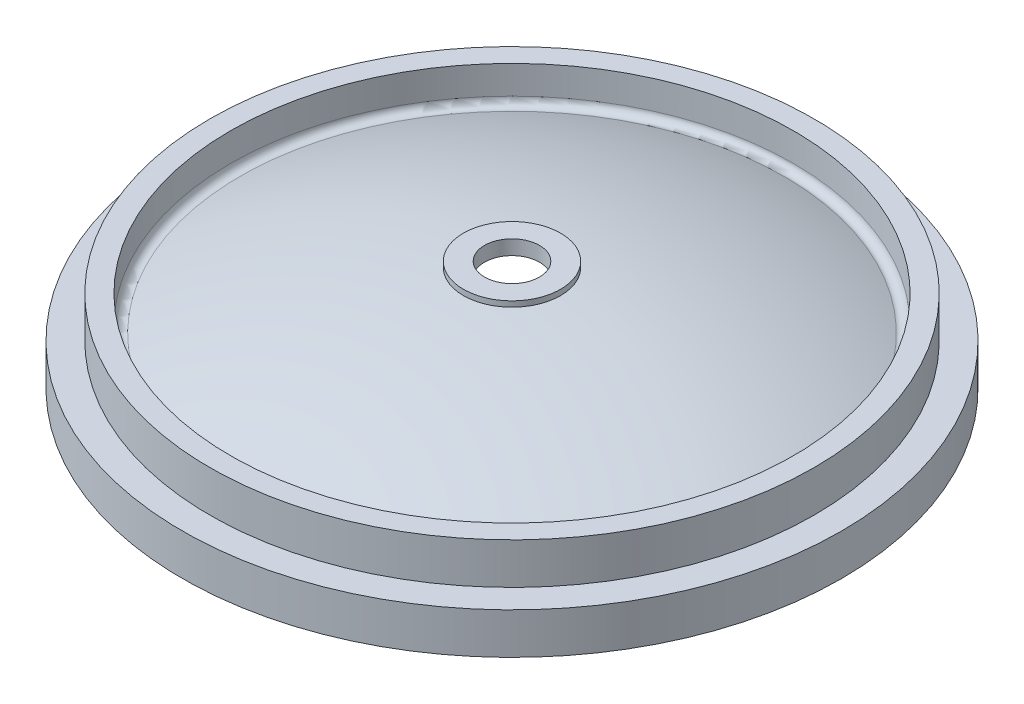
ISO-10303-21;
HEADER;
FILE_DESCRIPTION(('STEP AP214'),'2;1');
FILE_NAME('part.step','',(''),(''),'','','');
FILE_SCHEMA(('AUTOMOTIVE_DESIGN { 1 0 10303 214 1 1 1 1 }'));
ENDSEC;
DATA;
#1=APPLICATION_CONTEXT('core data for automotive mechanical design processes');
#2=APPLICATION_PROTOCOL_DEFINITION('international standard','automotive_design',2000,#1);
#3=PRODUCT_CONTEXT('',#1,'mechanical');
#4=PRODUCT('Part','Part','',(#3));
#5=PRODUCT_RELATED_PRODUCT_CATEGORY('part','',(#4));
#6=PRODUCT_DEFINITION_FORMATION('','',#4);
#7=PRODUCT_DEFINITION_CONTEXT('part definition',#1,'design');
#8=PRODUCT_DEFINITION('design','',#6,#7);
#9=PRODUCT_DEFINITION_SHAPE('','',#8);
#10=(LENGTH_UNIT() NAMED_UNIT(*) SI_UNIT(.MILLI.,.METRE.));
#11=(NAMED_UNIT(*) PLANE_ANGLE_UNIT() SI_UNIT($,.RADIAN.));
#12=(NAMED_UNIT(*) SI_UNIT($,.STERADIAN.) SOLID_ANGLE_UNIT());
#13=UNCERTAINTY_MEASURE_WITH_UNIT(LENGTH_MEASURE(1.E-05),#10,'distance_accuracy_value','');
#14=(GEOMETRIC_REPRESENTATION_CONTEXT(3) GLOBAL_UNCERTAINTY_ASSIGNED_CONTEXT((#13)) GLOBAL_UNIT_ASSIGNED_CONTEXT((#10,
#11,#12)) REPRESENTATION_CONTEXT('',''));
#15=CARTESIAN_POINT('',(0.,0.,0.));
#16=DIRECTION('',(0.,0.,1.));
#17=DIRECTION('',(1.,0.,0.));
#18=AXIS2_PLACEMENT_3D('',#15,#16,#17);
#19=CARTESIAN_POINT('',(0.,50.9224566717079,0.));
#20=DIRECTION('',(0.,1.,0.));
#21=DIRECTION('',(-1.,0.,0.));
#22=AXIS2_PLACEMENT_3D('',#19,#20,#21);
#23=CYLINDRICAL_SURFACE('',#22,139.7);
#24=CARTESIAN_POINT('',(0.,38.1,0.));
#25=DIRECTION('',(0.,1.,0.));
#26=DIRECTION('',(-1.,0.,0.));
#27=AXIS2_PLACEMENT_3D('',#24,#25,#26);
#28=CIRCLE('',#27,139.7);
#29=CARTESIAN_POINT('',(-139.7,38.0999999999999,0.));
#30=VERTEX_POINT('',#29);
#31=EDGE_CURVE('E44',#30,#30,#28,.T.);
#32=ORIENTED_EDGE('',*,*,#31,.F.);
#33=EDGE_LOOP('',(#32));
#34=FACE_BOUND('',#33,.T.);
#35=CARTESIAN_POINT('',(0.,19.05,0.));
#36=DIRECTION('',(0.,1.,0.));
#37=DIRECTION('',(-1.,0.,0.));
#38=AXIS2_PLACEMENT_3D('',#35,#36,#37);
#39=CIRCLE('',#38,139.7);
#40=CARTESIAN_POINT('',(-139.7,19.0499999999999,0.));
#41=VERTEX_POINT('',#40);
#42=EDGE_CURVE('E71',#41,#41,#39,.T.);
#43=ORIENTED_EDGE('',*,*,#42,.T.);
#44=EDGE_LOOP('',(#43));
#45=FACE_BOUND('',#44,.T.);
#46=ADVANCED_FACE('F33',(#34,#45),#23,.T.);
#47=CARTESIAN_POINT('',(139.7,38.1,0.));
#48=DIRECTION('',(0.,-1.,0.));
#49=DIRECTION('',(1.,0.,0.));
#50=AXIS2_PLACEMENT_3D('',#47,#48,#49);
#51=PLANE('',#50);
#52=CARTESIAN_POINT('',(0.,38.1,0.));
#53=DIRECTION('',(0.,1.,0.));
#54=DIRECTION('',(-1.,0.,0.));
#55=AXIS2_PLACEMENT_3D('',#52,#53,#54);
#56=CIRCLE('',#55,130.175);
#57=CARTESIAN_POINT('',(-130.175,38.0999999999999,0.));
#58=VERTEX_POINT('',#57);
#59=EDGE_CURVE('E48',#58,#58,#56,.T.);
#60=ORIENTED_EDGE('',*,*,#59,.F.);
#61=EDGE_LOOP('',(#60));
#62=FACE_BOUND('',#61,.T.);
#63=ORIENTED_EDGE('',*,*,#31,.T.);
#64=EDGE_LOOP('',(#63));
#65=FACE_BOUND('',#64,.T.);
#66=ADVANCED_FACE('F103',(#62,#65),#51,.F.);
#67=CARTESIAN_POINT('',(0.,50.9224566717079,0.));
#68=DIRECTION('',(0.,1.,0.));
#69=DIRECTION('',(-1.,0.,0.));
#70=AXIS2_PLACEMENT_3D('',#67,#68,#69);
#71=CYLINDRICAL_SURFACE('',#70,130.175);
#72=CARTESIAN_POINT('',(0.,24.9826349484652,0.));
#73=DIRECTION('',(0.,-1.,0.));
#74=DIRECTION('',(1.,0.,0.));
#75=AXIS2_PLACEMENT_3D('',#72,#73,#74);
#76=CIRCLE('',#75,130.175);
#77=CARTESIAN_POINT('',(130.175,24.9826349484652,0.));
#78=VERTEX_POINT('',#77);
#79=EDGE_CURVE('E10',#78,#78,#76,.T.);
#80=ORIENTED_EDGE('',*,*,#79,.T.);
#81=EDGE_LOOP('',(#80));
#82=FACE_BOUND('',#81,.T.);
#83=ORIENTED_EDGE('',*,*,#59,.T.);
#84=EDGE_LOOP('',(#83));
#85=FACE_BOUND('',#84,.T.);
#86=ADVANCED_FACE('F98',(#82,#85),#71,.F.);
#87=CARTESIAN_POINT('',(0.,-255.5875,0.));
#88=DIRECTION('',(0.,1.,0.));
#89=DIRECTION('',(1.,0.,0.));
#90=AXIS2_PLACEMENT_3D('',#87,#88,#89);
#91=SPHERICAL_SURFACE('',#90,304.8);
#92=CARTESIAN_POINT('',(-1.00086987964441E-13,22.0901593304398,0.));
#93=DIRECTION('',(0.,-1.,0.));
#94=DIRECTION('',(1.,0.,0.));
#95=AXIS2_PLACEMENT_3D('',#92,#93,#94);
#96=CIRCLE('',#95,125.690721649485);
#97=CARTESIAN_POINT('',(125.690721649484,22.0901593304398,0.));
#98=VERTEX_POINT('',#97);
#99=EDGE_CURVE('E40',#98,#98,#96,.F.);
#100=ORIENTED_EDGE('',*,*,#99,.T.);
#101=EDGE_LOOP('',(#100));
#102=FACE_BOUND('',#101,.T.);
#103=CARTESIAN_POINT('',(0.,48.3824566717079,0.));
#104=DIRECTION('',(0.,1.,0.));
#105=DIRECTION('',(-1.,0.,0.));
#106=AXIS2_PLACEMENT_3D('',#103,#104,#105);
#107=CIRCLE('',#106,22.479);
#108=CARTESIAN_POINT('',(-22.479,48.3824566717079,0.));
#109=VERTEX_POINT('',#108);
#110=EDGE_CURVE('E53',#109,#109,#107,.T.);
#111=ORIENTED_EDGE('',*,*,#110,.F.);
#112=EDGE_LOOP('',(#111));
#113=FACE_BOUND('',#112,.T.);
#114=ADVANCED_FACE('F93',(#102,#113),#91,.T.);
#115=CARTESIAN_POINT('',(0.,50.9224566717079,0.));
#116=DIRECTION('',(0.,1.,0.));
#117=DIRECTION('',(-1.,0.,0.));
#118=AXIS2_PLACEMENT_3D('',#115,#116,#117);
#119=CYLINDRICAL_SURFACE('',#118,22.479);
#120=CARTESIAN_POINT('',(0.,50.9224566717079,0.));
#121=DIRECTION('',(0.,1.,0.));
#122=DIRECTION('',(-1.,0.,0.));
#123=AXIS2_PLACEMENT_3D('',#120,#121,#122);
#124=CIRCLE('',#123,22.479);
#125=CARTESIAN_POINT('',(-22.479,50.9224566717079,0.));
#126=VERTEX_POINT('',#125);
#127=EDGE_CURVE('E56',#126,#126,#124,.T.);
#128=ORIENTED_EDGE('',*,*,#127,.F.);
#129=EDGE_LOOP('',(#128));
#130=FACE_BOUND('',#129,.T.);
#131=ORIENTED_EDGE('',*,*,#110,.T.);
#132=EDGE_LOOP('',(#131));
#133=FACE_BOUND('',#132,.T.);
#134=ADVANCED_FACE('F87',(#130,#133),#119,.T.);
#135=CARTESIAN_POINT('',(22.479,50.9224566717079,0.));
#136=DIRECTION('',(0.,-1.,0.));
#137=DIRECTION('',(1.,0.,0.));
#138=AXIS2_PLACEMENT_3D('',#135,#136,#137);
#139=PLANE('',#138);
#140=CARTESIAN_POINT('',(0.,50.9224566717079,0.));
#141=DIRECTION('',(0.,1.,0.));
#142=DIRECTION('',(0.,0.,1.));
#143=AXIS2_PLACEMENT_3D('',#140,#141,#142);
#144=CIRCLE('',#143,12.7);
#145=CARTESIAN_POINT('',(0.,50.9224566717079,12.7));
#146=VERTEX_POINT('',#145);
#147=EDGE_CURVE('E77',#146,#146,#144,.T.);
#148=ORIENTED_EDGE('',*,*,#147,.F.);
#149=EDGE_LOOP('',(#148));
#150=FACE_BOUND('',#149,.T.);
#151=ORIENTED_EDGE('',*,*,#127,.T.);
#152=EDGE_LOOP('',(#151));
#153=FACE_BOUND('',#152,.T.);
#154=ADVANCED_FACE('F83',(#150,#153),#139,.F.);
#155=CARTESIAN_POINT('',(0.,-247.65,0.));
#156=DIRECTION('',(0.,1.,0.));
#157=DIRECTION('',(1.,0.,0.));
#158=AXIS2_PLACEMENT_3D('',#155,#156,#157);
#159=SPHERICAL_SURFACE('',#158,292.1);
#160=CARTESIAN_POINT('',(0.,44.1737824441318,0.));
#161=DIRECTION('',(0.,-1.,0.));
#162=DIRECTION('',(0.,0.,-1.));
#163=AXIS2_PLACEMENT_3D('',#160,#161,#162);
#164=CIRCLE('',#163,12.7);
#165=CARTESIAN_POINT('',(0.,44.1737824441318,-12.7));
#166=VERTEX_POINT('',#165);
#167=EDGE_CURVE('E74',#166,#166,#164,.F.);
#168=ORIENTED_EDGE('',*,*,#167,.T.);
#169=EDGE_LOOP('',(#168));
#170=FACE_BOUND('',#169,.T.);
#171=CARTESIAN_POINT('',(0.,4.39281103366138,0.));
#172=DIRECTION('',(0.,1.,0.));
#173=DIRECTION('',(-1.,0.,0.));
#174=AXIS2_PLACEMENT_3D('',#171,#172,#173);
#175=CIRCLE('',#174,147.6375);
#176=CARTESIAN_POINT('',(-147.6375,4.39281103366132,0.));
#177=VERTEX_POINT('',#176);
#178=EDGE_CURVE('E59',#177,#177,#175,.T.);
#179=ORIENTED_EDGE('',*,*,#178,.F.);
#180=EDGE_LOOP('',(#179));
#181=FACE_BOUND('',#180,.T.);
#182=ADVANCED_FACE('F86',(#170,#181),#159,.F.);
#183=CARTESIAN_POINT('',(0.,50.9224566717079,0.));
#184=DIRECTION('',(0.,1.,0.));
#185=DIRECTION('',(-1.,0.,0.));
#186=AXIS2_PLACEMENT_3D('',#183,#184,#185);
#187=CYLINDRICAL_SURFACE('',#186,147.6375);
#188=CARTESIAN_POINT('',(0.,0.,0.));
#189=DIRECTION('',(0.,1.,0.));
#190=DIRECTION('',(-1.,0.,0.));
#191=AXIS2_PLACEMENT_3D('',#188,#189,#190);
#192=CIRCLE('',#191,147.6375);
#193=CARTESIAN_POINT('',(-147.6375,-1.08726064959754E-13,0.));
#194=VERTEX_POINT('',#193);
#195=EDGE_CURVE('E62',#194,#194,#192,.T.);
#196=ORIENTED_EDGE('',*,*,#195,.F.);
#197=EDGE_LOOP('',(#196));
#198=FACE_BOUND('',#197,.T.);
#199=ORIENTED_EDGE('',*,*,#178,.T.);
#200=EDGE_LOOP('',(#199));
#201=FACE_BOUND('',#200,.T.);
#202=ADVANCED_FACE('F131',(#198,#201),#187,.F.);
#203=CARTESIAN_POINT('',(152.4,0.,0.));
#204=DIRECTION('',(0.,1.,0.));
#205=DIRECTION('',(-1.,0.,0.));
#206=AXIS2_PLACEMENT_3D('',#203,#204,#205);
#207=PLANE('',#206);
#208=CARTESIAN_POINT('',(0.,0.,0.));
#209=DIRECTION('',(0.,1.,0.));
#210=DIRECTION('',(-1.,0.,0.));
#211=AXIS2_PLACEMENT_3D('',#208,#209,#210);
#212=CIRCLE('',#211,152.4);
#213=CARTESIAN_POINT('',(-152.4,-1.10442675080028E-13,0.));
#214=VERTEX_POINT('',#213);
#215=EDGE_CURVE('E65',#214,#214,#212,.T.);
#216=ORIENTED_EDGE('',*,*,#215,.F.);
#217=EDGE_LOOP('',(#216));
#218=FACE_BOUND('',#217,.T.);
#219=ORIENTED_EDGE('',*,*,#195,.T.);
#220=EDGE_LOOP('',(#219));
#221=FACE_BOUND('',#220,.T.);
#222=ADVANCED_FACE('F125',(#218,#221),#207,.F.);
#223=CARTESIAN_POINT('',(0.,50.9224566717079,0.));
#224=DIRECTION('',(0.,1.,0.));
#225=DIRECTION('',(-1.,0.,0.));
#226=AXIS2_PLACEMENT_3D('',#223,#224,#225);
#227=CYLINDRICAL_SURFACE('',#226,152.4);
#228=CARTESIAN_POINT('',(0.,19.0499999999999,0.));
#229=DIRECTION('',(0.,1.,0.));
#230=DIRECTION('',(-1.,0.,0.));
#231=AXIS2_PLACEMENT_3D('',#228,#229,#230);
#232=CIRCLE('',#231,152.4);
#233=CARTESIAN_POINT('',(-152.4,19.0499999999999,0.));
#234=VERTEX_POINT('',#233);
#235=EDGE_CURVE('E68',#234,#234,#232,.T.);
#236=ORIENTED_EDGE('',*,*,#235,.F.);
#237=EDGE_LOOP('',(#236));
#238=FACE_BOUND('',#237,.T.);
#239=ORIENTED_EDGE('',*,*,#215,.T.);
#240=EDGE_LOOP('',(#239));
#241=FACE_BOUND('',#240,.T.);
#242=ADVANCED_FACE('F119',(#238,#241),#227,.T.);
#243=CARTESIAN_POINT('',(152.4,19.05,0.));
#244=DIRECTION('',(0.,-1.,0.));
#245=DIRECTION('',(1.,0.,0.));
#246=AXIS2_PLACEMENT_3D('',#243,#244,#245);
#247=PLANE('',#246);
#248=ORIENTED_EDGE('',*,*,#42,.F.);
#249=EDGE_LOOP('',(#248));
#250=FACE_BOUND('',#249,.T.);
#251=ORIENTED_EDGE('',*,*,#235,.T.);
#252=EDGE_LOOP('',(#251));
#253=FACE_BOUND('',#252,.T.);
#254=ADVANCED_FACE('F116',(#250,#253),#247,.F.);
#255=CARTESIAN_POINT('',(0.,24.9826349484652,0.));
#256=DIRECTION('',(0.,-1.,0.));
#257=DIRECTION('',(1.,0.,0.));
#258=AXIS2_PLACEMENT_3D('',#255,#256,#257);
#259=TOROIDAL_SURFACE('',#258,127.,3.175);
#260=ORIENTED_EDGE('',*,*,#79,.F.);
#261=EDGE_LOOP('',(#260));
#262=FACE_BOUND('',#261,.T.);
#263=ORIENTED_EDGE('',*,*,#99,.F.);
#264=EDGE_LOOP('',(#263));
#265=FACE_BOUND('',#264,.T.);
#266=ADVANCED_FACE('F35',(#262,#265),#259,.F.);
#267=CARTESIAN_POINT('',(0.,50.9224566717079,0.));
#268=DIRECTION('',(0.,1.,0.));
#269=DIRECTION('',(0.,0.,1.));
#270=AXIS2_PLACEMENT_3D('',#267,#268,#269);
#271=CYLINDRICAL_SURFACE('',#270,12.7);
#272=ORIENTED_EDGE('',*,*,#167,.F.);
#273=EDGE_LOOP('',(#272));
#274=FACE_BOUND('',#273,.T.);
#275=ORIENTED_EDGE('',*,*,#147,.T.);
#276=EDGE_LOOP('',(#275));
#277=FACE_BOUND('',#276,.T.);
#278=ADVANCED_FACE('F81',(#274,#277),#271,.F.);
#279=CLOSED_SHELL('',(#46,#66,#86,#114,#134,#154,#182,#202,#222,#242,#254,#266,#278));
#280=MANIFOLD_SOLID_BREP('B2',#279);
#281=ADVANCED_BREP_SHAPE_REPRESENTATION('',(#18,#280),#14);
#282=SHAPE_DEFINITION_REPRESENTATION(#9,#281);
ENDSEC;
END-ISO-10303-21;
